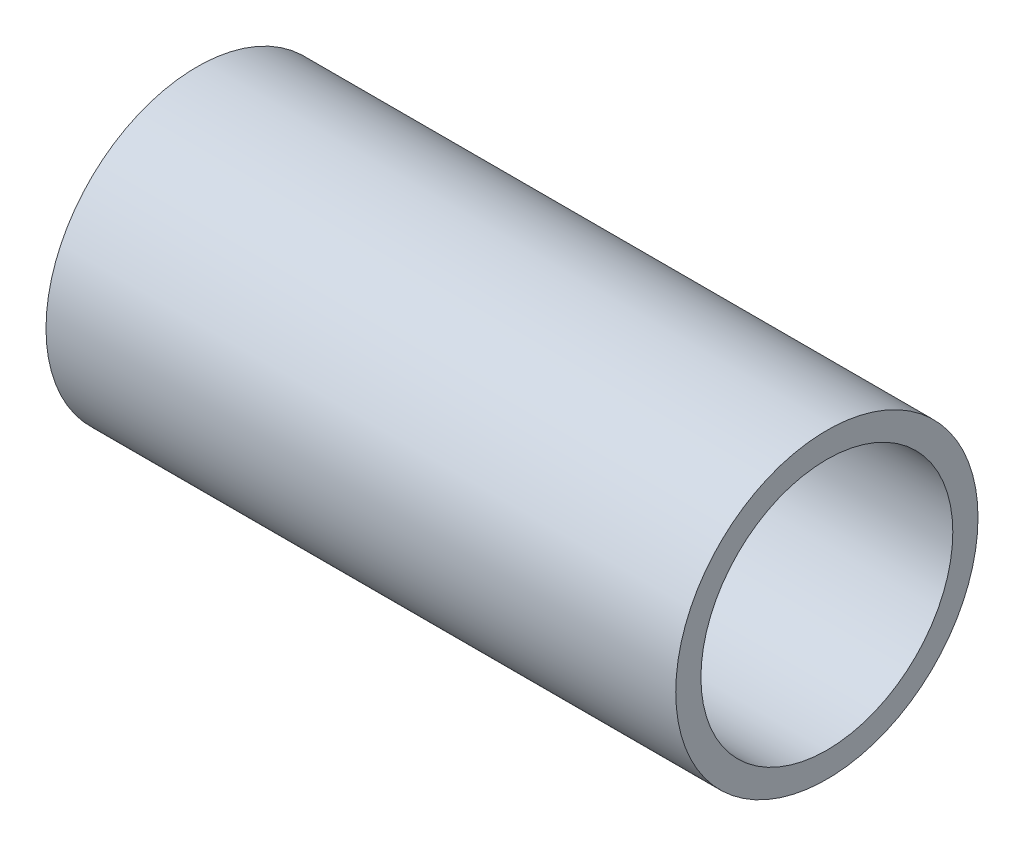
ISO-10303-21;
HEADER;
FILE_DESCRIPTION(('STEP AP214'),'2;1');
FILE_NAME('part.step','',(''),(''),'','','');
FILE_SCHEMA(('AUTOMOTIVE_DESIGN { 1 0 10303 214 1 1 1 1 }'));
ENDSEC;
DATA;
#1=APPLICATION_CONTEXT('core data for automotive mechanical design processes');
#2=APPLICATION_PROTOCOL_DEFINITION('international standard','automotive_design',2000,#1);
#3=PRODUCT_CONTEXT('',#1,'mechanical');
#4=PRODUCT('Part','Part','',(#3));
#5=PRODUCT_RELATED_PRODUCT_CATEGORY('part','',(#4));
#6=PRODUCT_DEFINITION_FORMATION('','',#4);
#7=PRODUCT_DEFINITION_CONTEXT('part definition',#1,'design');
#8=PRODUCT_DEFINITION('design','',#6,#7);
#9=PRODUCT_DEFINITION_SHAPE('','',#8);
#10=(LENGTH_UNIT() NAMED_UNIT(*) SI_UNIT(.MILLI.,.METRE.));
#11=(NAMED_UNIT(*) PLANE_ANGLE_UNIT() SI_UNIT($,.RADIAN.));
#12=(NAMED_UNIT(*) SI_UNIT($,.STERADIAN.) SOLID_ANGLE_UNIT());
#13=UNCERTAINTY_MEASURE_WITH_UNIT(LENGTH_MEASURE(1.E-05),#10,'distance_accuracy_value','');
#14=(GEOMETRIC_REPRESENTATION_CONTEXT(3) GLOBAL_UNCERTAINTY_ASSIGNED_CONTEXT((#13)) GLOBAL_UNIT_ASSIGNED_CONTEXT((#10,
#11,#12)) REPRESENTATION_CONTEXT('',''));
#15=CARTESIAN_POINT('',(0.,0.,0.));
#16=DIRECTION('',(0.,0.,1.));
#17=DIRECTION('',(1.,0.,0.));
#18=AXIS2_PLACEMENT_3D('',#15,#16,#17);
#19=CARTESIAN_POINT('',(0.,0.,0.));
#20=DIRECTION('',(-1.,0.,0.));
#21=DIRECTION('',(0.,0.,1.));
#22=AXIS2_PLACEMENT_3D('',#19,#20,#21);
#23=CYLINDRICAL_SURFACE('',#22,5.);
#24=CARTESIAN_POINT('',(0.,0.,0.));
#25=DIRECTION('',(-1.,0.,0.));
#26=DIRECTION('',(0.,0.,1.));
#27=AXIS2_PLACEMENT_3D('',#24,#25,#26);
#28=CIRCLE('',#27,5.);
#29=CARTESIAN_POINT('',(0.,0.,5.));
#30=VERTEX_POINT('',#29);
#31=EDGE_CURVE('E55',#30,#30,#28,.T.);
#32=ORIENTED_EDGE('',*,*,#31,.T.);
#33=EDGE_LOOP('',(#32));
#34=FACE_BOUND('',#33,.T.);
#35=CARTESIAN_POINT('',(25.,0.,0.));
#36=DIRECTION('',(-1.,0.,0.));
#37=DIRECTION('',(0.,0.,1.));
#38=AXIS2_PLACEMENT_3D('',#35,#36,#37);
#39=CIRCLE('',#38,5.);
#40=CARTESIAN_POINT('',(25.,0.,5.));
#41=VERTEX_POINT('',#40);
#42=EDGE_CURVE('E10',#41,#41,#39,.T.);
#43=ORIENTED_EDGE('',*,*,#42,.F.);
#44=EDGE_LOOP('',(#43));
#45=FACE_BOUND('',#44,.T.);
#46=ADVANCED_FACE('F41',(#34,#45),#23,.F.);
#47=CARTESIAN_POINT('',(25.,0.,0.));
#48=DIRECTION('',(1.,0.,0.));
#49=DIRECTION('',(0.,0.,-1.));
#50=AXIS2_PLACEMENT_3D('',#47,#48,#49);
#51=PLANE('',#50);
#52=ORIENTED_EDGE('',*,*,#42,.T.);
#53=EDGE_LOOP('',(#52));
#54=FACE_BOUND('',#53,.T.);
#55=CARTESIAN_POINT('',(25.,0.,0.));
#56=DIRECTION('',(-1.,0.,0.));
#57=DIRECTION('',(0.,0.,1.));
#58=AXIS2_PLACEMENT_3D('',#55,#56,#57);
#59=CIRCLE('',#58,6.);
#60=CARTESIAN_POINT('',(25.,0.,6.));
#61=VERTEX_POINT('',#60);
#62=EDGE_CURVE('E47',#61,#61,#59,.T.);
#63=ORIENTED_EDGE('',*,*,#62,.F.);
#64=EDGE_LOOP('',(#63));
#65=FACE_BOUND('',#64,.T.);
#66=ADVANCED_FACE('F71',(#54,#65),#51,.T.);
#67=CARTESIAN_POINT('',(0.,0.,0.));
#68=DIRECTION('',(-1.,0.,0.));
#69=DIRECTION('',(0.,0.,1.));
#70=AXIS2_PLACEMENT_3D('',#67,#68,#69);
#71=CYLINDRICAL_SURFACE('',#70,6.);
#72=ORIENTED_EDGE('',*,*,#62,.T.);
#73=EDGE_LOOP('',(#72));
#74=FACE_BOUND('',#73,.T.);
#75=CARTESIAN_POINT('',(0.,0.,0.));
#76=DIRECTION('',(-1.,0.,0.));
#77=DIRECTION('',(0.,0.,1.));
#78=AXIS2_PLACEMENT_3D('',#75,#76,#77);
#79=CIRCLE('',#78,6.);
#80=CARTESIAN_POINT('',(0.,0.,6.));
#81=VERTEX_POINT('',#80);
#82=EDGE_CURVE('E51',#81,#81,#79,.T.);
#83=ORIENTED_EDGE('',*,*,#82,.F.);
#84=EDGE_LOOP('',(#83));
#85=FACE_BOUND('',#84,.T.);
#86=ADVANCED_FACE('F65',(#74,#85),#71,.T.);
#87=CARTESIAN_POINT('',(0.,0.,0.));
#88=DIRECTION('',(-1.,0.,0.));
#89=DIRECTION('',(0.,0.,1.));
#90=AXIS2_PLACEMENT_3D('',#87,#88,#89);
#91=PLANE('',#90);
#92=ORIENTED_EDGE('',*,*,#82,.T.);
#93=EDGE_LOOP('',(#92));
#94=FACE_BOUND('',#93,.T.);
#95=ORIENTED_EDGE('',*,*,#31,.F.);
#96=EDGE_LOOP('',(#95));
#97=FACE_BOUND('',#96,.T.);
#98=ADVANCED_FACE('F63',(#94,#97),#91,.T.);
#99=CLOSED_SHELL('',(#46,#66,#86,#98));
#100=MANIFOLD_SOLID_BREP('B2',#99);
#101=ADVANCED_BREP_SHAPE_REPRESENTATION('',(#18,#100),#14);
#102=SHAPE_DEFINITION_REPRESENTATION(#9,#101);
ENDSEC;
END-ISO-10303-21;
